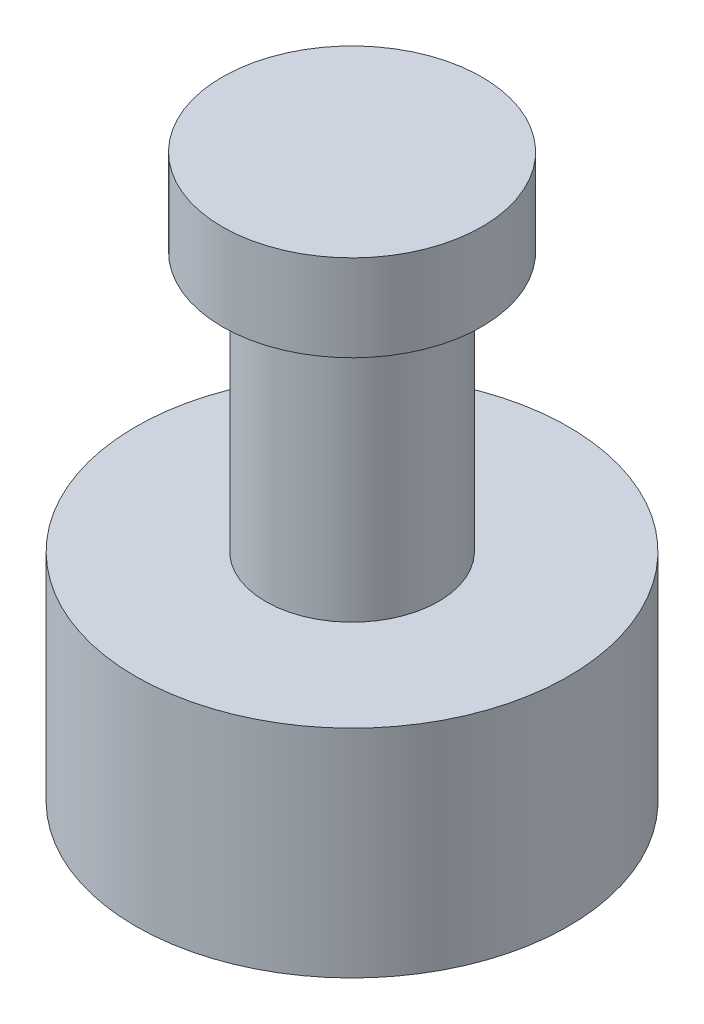
ISO-10303-21;
HEADER;
FILE_DESCRIPTION(('STEP AP214'),'2;1');
FILE_NAME('part.step','',(''),(''),'','','');
FILE_SCHEMA(('AUTOMOTIVE_DESIGN { 1 0 10303 214 1 1 1 1 }'));
ENDSEC;
DATA;
#1=APPLICATION_CONTEXT('core data for automotive mechanical design processes');
#2=APPLICATION_PROTOCOL_DEFINITION('international standard','automotive_design',2000,#1);
#3=PRODUCT_CONTEXT('',#1,'mechanical');
#4=PRODUCT('Part','Part','',(#3));
#5=PRODUCT_RELATED_PRODUCT_CATEGORY('part','',(#4));
#6=PRODUCT_DEFINITION_FORMATION('','',#4);
#7=PRODUCT_DEFINITION_CONTEXT('part definition',#1,'design');
#8=PRODUCT_DEFINITION('design','',#6,#7);
#9=PRODUCT_DEFINITION_SHAPE('','',#8);
#10=(LENGTH_UNIT() NAMED_UNIT(*) SI_UNIT(.MILLI.,.METRE.));
#11=(NAMED_UNIT(*) PLANE_ANGLE_UNIT() SI_UNIT($,.RADIAN.));
#12=(NAMED_UNIT(*) SI_UNIT($,.STERADIAN.) SOLID_ANGLE_UNIT());
#13=UNCERTAINTY_MEASURE_WITH_UNIT(LENGTH_MEASURE(1.E-05),#10,'distance_accuracy_value','');
#14=(GEOMETRIC_REPRESENTATION_CONTEXT(3) GLOBAL_UNCERTAINTY_ASSIGNED_CONTEXT((#13)) GLOBAL_UNIT_ASSIGNED_CONTEXT((#10,
#11,#12)) REPRESENTATION_CONTEXT('',''));
#15=CARTESIAN_POINT('',(0.,0.,0.));
#16=DIRECTION('',(0.,0.,1.));
#17=DIRECTION('',(1.,0.,0.));
#18=AXIS2_PLACEMENT_3D('',#15,#16,#17);
#19=CARTESIAN_POINT('',(0.,5.,0.));
#20=DIRECTION('',(0.,1.,0.));
#21=DIRECTION('',(0.,0.,1.));
#22=AXIS2_PLACEMENT_3D('',#19,#20,#21);
#23=PLANE('',#22);
#24=CARTESIAN_POINT('',(0.,5.,0.));
#25=DIRECTION('',(0.,1.,0.));
#26=DIRECTION('',(0.,0.,1.));
#27=AXIS2_PLACEMENT_3D('',#24,#25,#26);
#28=CIRCLE('',#27,5.);
#29=CARTESIAN_POINT('',(0.,5.,5.));
#30=VERTEX_POINT('',#29);
#31=EDGE_CURVE('E10',#30,#30,#28,.T.);
#32=ORIENTED_EDGE('',*,*,#31,.T.);
#33=EDGE_LOOP('',(#32));
#34=FACE_BOUND('',#33,.T.);
#35=CARTESIAN_POINT('',(0.,5.,0.));
#36=DIRECTION('',(0.,1.,0.));
#37=DIRECTION('',(0.,0.,1.));
#38=AXIS2_PLACEMENT_3D('',#35,#36,#37);
#39=CIRCLE('',#38,2.);
#40=CARTESIAN_POINT('',(0.,5.,2.));
#41=VERTEX_POINT('',#40);
#42=EDGE_CURVE('E27',#41,#41,#39,.T.);
#43=ORIENTED_EDGE('',*,*,#42,.F.);
#44=EDGE_LOOP('',(#43));
#45=FACE_BOUND('',#44,.T.);
#46=ADVANCED_FACE('F14',(#34,#45),#23,.T.);
#47=CARTESIAN_POINT('',(0.,5.,0.));
#48=DIRECTION('',(0.,-1.,0.));
#49=DIRECTION('',(0.,0.,-1.));
#50=AXIS2_PLACEMENT_3D('',#47,#48,#49);
#51=CYLINDRICAL_SURFACE('',#50,5.);
#52=ORIENTED_EDGE('',*,*,#31,.F.);
#53=EDGE_LOOP('',(#52));
#54=FACE_BOUND('',#53,.T.);
#55=CARTESIAN_POINT('',(0.,0.,0.));
#56=DIRECTION('',(0.,1.,0.));
#57=DIRECTION('',(0.,0.,1.));
#58=AXIS2_PLACEMENT_3D('',#55,#56,#57);
#59=CIRCLE('',#58,5.);
#60=CARTESIAN_POINT('',(0.,0.,5.));
#61=VERTEX_POINT('',#60);
#62=EDGE_CURVE('E18',#61,#61,#59,.T.);
#63=ORIENTED_EDGE('',*,*,#62,.T.);
#64=EDGE_LOOP('',(#63));
#65=FACE_BOUND('',#64,.T.);
#66=ADVANCED_FACE('F16',(#54,#65),#51,.T.);
#67=CARTESIAN_POINT('',(0.,0.,0.));
#68=DIRECTION('',(0.,1.,0.));
#69=DIRECTION('',(0.,0.,1.));
#70=AXIS2_PLACEMENT_3D('',#67,#68,#69);
#71=PLANE('',#70);
#72=ORIENTED_EDGE('',*,*,#62,.F.);
#73=EDGE_LOOP('',(#72));
#74=FACE_BOUND('',#73,.T.);
#75=ADVANCED_FACE('F56',(#74),#71,.F.);
#76=CARTESIAN_POINT('',(0.,11.,0.));
#77=DIRECTION('',(0.,-1.,0.));
#78=DIRECTION('',(0.,0.,-1.));
#79=AXIS2_PLACEMENT_3D('',#76,#77,#78);
#80=CYLINDRICAL_SURFACE('',#79,2.);
#81=CARTESIAN_POINT('',(0.,11.,0.));
#82=DIRECTION('',(0.,1.,0.));
#83=DIRECTION('',(0.,0.,1.));
#84=AXIS2_PLACEMENT_3D('',#81,#82,#83);
#85=CIRCLE('',#84,2.);
#86=CARTESIAN_POINT('',(0.,11.,2.));
#87=VERTEX_POINT('',#86);
#88=EDGE_CURVE('E25',#87,#87,#85,.T.);
#89=ORIENTED_EDGE('',*,*,#88,.F.);
#90=EDGE_LOOP('',(#89));
#91=FACE_BOUND('',#90,.T.);
#92=ORIENTED_EDGE('',*,*,#42,.T.);
#93=EDGE_LOOP('',(#92));
#94=FACE_BOUND('',#93,.T.);
#95=ADVANCED_FACE('F50',(#91,#94),#80,.T.);
#96=CARTESIAN_POINT('',(0.,11.,0.));
#97=DIRECTION('',(0.,1.,0.));
#98=DIRECTION('',(0.,0.,1.));
#99=AXIS2_PLACEMENT_3D('',#96,#97,#98);
#100=PLANE('',#99);
#101=CARTESIAN_POINT('',(0.,11.,0.));
#102=DIRECTION('',(0.,1.,0.));
#103=DIRECTION('',(0.,0.,1.));
#104=AXIS2_PLACEMENT_3D('',#101,#102,#103);
#105=CIRCLE('',#104,3.);
#106=CARTESIAN_POINT('',(0.,11.,3.));
#107=VERTEX_POINT('',#106);
#108=EDGE_CURVE('E33',#107,#107,#105,.T.);
#109=ORIENTED_EDGE('',*,*,#108,.F.);
#110=EDGE_LOOP('',(#109));
#111=FACE_BOUND('',#110,.T.);
#112=ORIENTED_EDGE('',*,*,#88,.T.);
#113=EDGE_LOOP('',(#112));
#114=FACE_BOUND('',#113,.T.);
#115=ADVANCED_FACE('F44',(#111,#114),#100,.F.);
#116=CARTESIAN_POINT('',(0.,13.,0.));
#117=DIRECTION('',(0.,-1.,0.));
#118=DIRECTION('',(0.,0.,-1.));
#119=AXIS2_PLACEMENT_3D('',#116,#117,#118);
#120=CYLINDRICAL_SURFACE('',#119,3.);
#121=CARTESIAN_POINT('',(0.,13.,0.));
#122=DIRECTION('',(0.,1.,0.));
#123=DIRECTION('',(0.,0.,1.));
#124=AXIS2_PLACEMENT_3D('',#121,#122,#123);
#125=CIRCLE('',#124,3.);
#126=CARTESIAN_POINT('',(0.,13.,3.));
#127=VERTEX_POINT('',#126);
#128=EDGE_CURVE('E30',#127,#127,#125,.T.);
#129=ORIENTED_EDGE('',*,*,#128,.F.);
#130=EDGE_LOOP('',(#129));
#131=FACE_BOUND('',#130,.T.);
#132=ORIENTED_EDGE('',*,*,#108,.T.);
#133=EDGE_LOOP('',(#132));
#134=FACE_BOUND('',#133,.T.);
#135=ADVANCED_FACE('F41',(#131,#134),#120,.T.);
#136=CARTESIAN_POINT('',(0.,13.,0.));
#137=DIRECTION('',(0.,1.,0.));
#138=DIRECTION('',(0.,0.,1.));
#139=AXIS2_PLACEMENT_3D('',#136,#137,#138);
#140=PLANE('',#139);
#141=ORIENTED_EDGE('',*,*,#128,.T.);
#142=EDGE_LOOP('',(#141));
#143=FACE_BOUND('',#142,.T.);
#144=ADVANCED_FACE('F39',(#143),#140,.T.);
#145=CLOSED_SHELL('',(#46,#66,#75,#95,#115,#135,#144));
#146=MANIFOLD_SOLID_BREP('B1',#145);
#147=ADVANCED_BREP_SHAPE_REPRESENTATION('',(#18,#146),#14);
#148=SHAPE_DEFINITION_REPRESENTATION(#9,#147);
ENDSEC;
END-ISO-10303-21;
